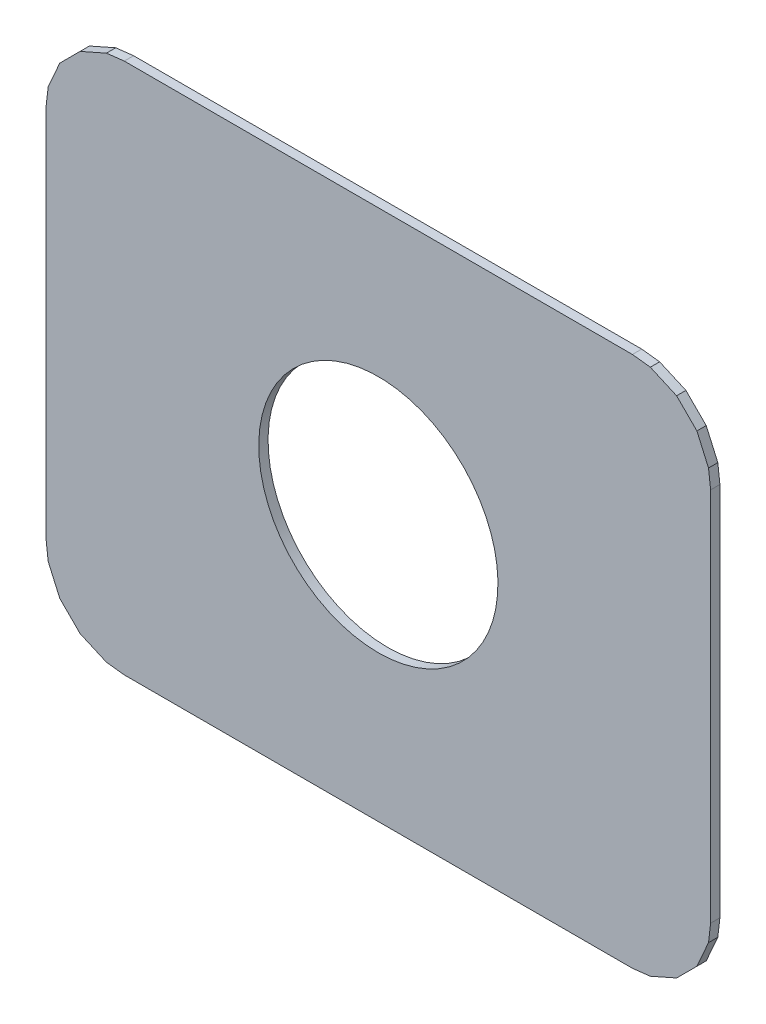
ISO-10303-21;
HEADER;
FILE_DESCRIPTION(('STEP AP214'),'2;1');
FILE_NAME('part.step','',(''),(''),'','','');
FILE_SCHEMA(('AUTOMOTIVE_DESIGN { 1 0 10303 214 1 1 1 1 }'));
ENDSEC;
DATA;
#1=APPLICATION_CONTEXT('core data for automotive mechanical design processes');
#2=APPLICATION_PROTOCOL_DEFINITION('international standard','automotive_design',2000,#1);
#3=PRODUCT_CONTEXT('',#1,'mechanical');
#4=PRODUCT('Part','Part','',(#3));
#5=PRODUCT_RELATED_PRODUCT_CATEGORY('part','',(#4));
#6=PRODUCT_DEFINITION_FORMATION('','',#4);
#7=PRODUCT_DEFINITION_CONTEXT('part definition',#1,'design');
#8=PRODUCT_DEFINITION('design','',#6,#7);
#9=PRODUCT_DEFINITION_SHAPE('','',#8);
#10=(LENGTH_UNIT() NAMED_UNIT(*) SI_UNIT(.MILLI.,.METRE.));
#11=(NAMED_UNIT(*) PLANE_ANGLE_UNIT() SI_UNIT($,.RADIAN.));
#12=(NAMED_UNIT(*) SI_UNIT($,.STERADIAN.) SOLID_ANGLE_UNIT());
#13=UNCERTAINTY_MEASURE_WITH_UNIT(LENGTH_MEASURE(1.E-05),#10,'distance_accuracy_value','');
#14=(GEOMETRIC_REPRESENTATION_CONTEXT(3) GLOBAL_UNCERTAINTY_ASSIGNED_CONTEXT((#13)) GLOBAL_UNIT_ASSIGNED_CONTEXT((#10,
#11,#12)) REPRESENTATION_CONTEXT('',''));
#15=CARTESIAN_POINT('',(0.,0.,0.));
#16=DIRECTION('',(0.,0.,1.));
#17=DIRECTION('',(1.,0.,0.));
#18=AXIS2_PLACEMENT_3D('',#15,#16,#17);
#19=CARTESIAN_POINT('',(177.26,-119.456,-0.045));
#20=DIRECTION('',(0.,0.,-1.));
#21=DIRECTION('',(0.,-1.,0.));
#22=AXIS2_PLACEMENT_3D('',#19,#20,#21);
#23=CYLINDRICAL_SURFACE('',#22,0.45);
#24=CARTESIAN_POINT('',(177.26,-119.456,1.67));
#25=DIRECTION('',(0.,0.,-1.));
#26=DIRECTION('',(0.,-1.,0.));
#27=AXIS2_PLACEMENT_3D('',#24,#25,#26);
#28=CIRCLE('',#27,0.45);
#29=CARTESIAN_POINT('',(177.26,-119.906,1.67));
#30=VERTEX_POINT('',#29);
#31=EDGE_CURVE('E302',#30,#30,#28,.T.);
#32=ORIENTED_EDGE('',*,*,#31,.T.);
#33=DIRECTION('',(0.,0.,1.));
#34=VECTOR('',#33,1.);
#35=CARTESIAN_POINT('',(177.26,-119.906,-0.045));
#36=LINE('',#35,#34);
#37=CARTESIAN_POINT('',(177.26,-119.906,1.705));
#38=VERTEX_POINT('',#37);
#39=EDGE_CURVE('E11',#30,#38,#36,.T.);
#40=ORIENTED_EDGE('',*,*,#39,.T.);
#41=CARTESIAN_POINT('',(177.26,-119.456,1.705));
#42=DIRECTION('',(0.,0.,-1.));
#43=DIRECTION('',(0.,-1.,0.));
#44=AXIS2_PLACEMENT_3D('',#41,#42,#43);
#45=CIRCLE('',#44,0.45);
#46=EDGE_CURVE('E420',#38,#38,#45,.T.);
#47=ORIENTED_EDGE('',*,*,#46,.F.);
#48=ORIENTED_EDGE('',*,*,#39,.F.);
#49=EDGE_LOOP('',(#32,#40,#47,#48));
#50=FACE_BOUND('',#49,.T.);
#51=ADVANCED_FACE('F17',(#50),#23,.F.);
#52=CARTESIAN_POINT('',(176.23678,-120.448188,1.67));
#53=DIRECTION('',(-0.403918300516903,-0.91479506257278,0.));
#54=DIRECTION('',(-0.91479506257278,0.403918300516903,0.));
#55=AXIS2_PLACEMENT_3D('',#52,#53,#54);
#56=PLANE('',#55);
#57=DIRECTION('',(0.,0.,1.));
#58=VECTOR('',#57,1.);
#59=CARTESIAN_POINT('',(176.23678,-120.448188,1.67));
#60=LINE('',#59,#58);
#61=CARTESIAN_POINT('',(176.23678,-120.448188,1.67));
#62=VERTEX_POINT('',#61);
#63=CARTESIAN_POINT('',(176.23678,-120.448188,1.705));
#64=VERTEX_POINT('',#63);
#65=EDGE_CURVE('E26',#62,#64,#60,.T.);
#66=ORIENTED_EDGE('',*,*,#65,.T.);
#67=DIRECTION('',(-0.91479506257278,0.403918300516903,0.));
#68=VECTOR('',#67,1.);
#69=CARTESIAN_POINT('',(176.23678,-120.448188,1.705));
#70=LINE('',#69,#68);
#71=CARTESIAN_POINT('',(176.137901,-120.404529,1.705));
#72=VERTEX_POINT('',#71);
#73=EDGE_CURVE('E378',#64,#72,#70,.T.);
#74=ORIENTED_EDGE('',*,*,#73,.T.);
#75=DIRECTION('',(0.,0.,1.));
#76=VECTOR('',#75,1.);
#77=CARTESIAN_POINT('',(176.137901,-120.404529,1.67));
#78=LINE('',#77,#76);
#79=CARTESIAN_POINT('',(176.137901,-120.404529,1.67));
#80=VERTEX_POINT('',#79);
#81=EDGE_CURVE('E20',#80,#72,#78,.T.);
#82=ORIENTED_EDGE('',*,*,#81,.F.);
#83=DIRECTION('',(-0.91479506257278,0.403918300516903,0.));
#84=VECTOR('',#83,1.);
#85=CARTESIAN_POINT('',(176.23678,-120.448188,1.67));
#86=LINE('',#85,#84);
#87=EDGE_CURVE('E320',#62,#80,#86,.T.);
#88=ORIENTED_EDGE('',*,*,#87,.F.);
#89=EDGE_LOOP('',(#66,#74,#82,#88));
#90=FACE_BOUND('',#89,.T.);
#91=ADVANCED_FACE('F477',(#90),#56,.T.);
#92=CARTESIAN_POINT('',(176.304118,-120.456,1.67));
#93=DIRECTION('',(-0.115238869062998,-0.99333780913498,0.));
#94=DIRECTION('',(-0.99333780913498,0.115238869062998,0.));
#95=AXIS2_PLACEMENT_3D('',#92,#93,#94);
#96=PLANE('',#95);
#97=DIRECTION('',(0.,0.,1.));
#98=VECTOR('',#97,1.);
#99=CARTESIAN_POINT('',(176.304118,-120.456,1.67));
#100=LINE('',#99,#98);
#101=CARTESIAN_POINT('',(176.304118,-120.456,1.67));
#102=VERTEX_POINT('',#101);
#103=CARTESIAN_POINT('',(176.304118,-120.456,1.705));
#104=VERTEX_POINT('',#103);
#105=EDGE_CURVE('E457',#102,#104,#100,.T.);
#106=ORIENTED_EDGE('',*,*,#105,.T.);
#107=DIRECTION('',(-0.99333780913498,0.115238869062998,0.));
#108=VECTOR('',#107,1.);
#109=CARTESIAN_POINT('',(176.304118,-120.456,1.705));
#110=LINE('',#109,#108);
#111=EDGE_CURVE('E382',#104,#64,#110,.T.);
#112=ORIENTED_EDGE('',*,*,#111,.T.);
#113=ORIENTED_EDGE('',*,*,#65,.F.);
#114=DIRECTION('',(-0.99333780913498,0.115238869062998,0.));
#115=VECTOR('',#114,1.);
#116=CARTESIAN_POINT('',(176.304118,-120.456,1.67));
#117=LINE('',#116,#115);
#118=EDGE_CURVE('E316',#102,#62,#117,.T.);
#119=ORIENTED_EDGE('',*,*,#118,.F.);
#120=EDGE_LOOP('',(#106,#112,#113,#119));
#121=FACE_BOUND('',#120,.T.);
#122=ADVANCED_FACE('F513',(#121),#96,.T.);
#123=CARTESIAN_POINT('',(176.137901,-120.404529,1.67));
#124=DIRECTION('',(-0.707106781187048,-0.707106781186048,0.));
#125=DIRECTION('',(-0.707106781186048,0.707106781187048,0.));
#126=AXIS2_PLACEMENT_3D('',#123,#124,#125);
#127=PLANE('',#126);
#128=ORIENTED_EDGE('',*,*,#81,.T.);
#129=DIRECTION('',(-0.707106781186048,0.707106781187048,0.));
#130=VECTOR('',#129,1.);
#131=CARTESIAN_POINT('',(176.137901,-120.404529,1.705));
#132=LINE('',#131,#130);
#133=CARTESIAN_POINT('',(176.061471,-120.328099,1.705));
#134=VERTEX_POINT('',#133);
#135=EDGE_CURVE('E357',#72,#134,#132,.T.);
#136=ORIENTED_EDGE('',*,*,#135,.T.);
#137=DIRECTION('',(0.,0.,1.));
#138=VECTOR('',#137,1.);
#139=CARTESIAN_POINT('',(176.061471,-120.328099,1.67));
#140=LINE('',#139,#138);
#141=CARTESIAN_POINT('',(176.061471,-120.328099,1.67));
#142=VERTEX_POINT('',#141);
#143=EDGE_CURVE('E455',#142,#134,#140,.T.);
#144=ORIENTED_EDGE('',*,*,#143,.F.);
#145=DIRECTION('',(-0.707106781186048,0.707106781187048,0.));
#146=VECTOR('',#145,1.);
#147=CARTESIAN_POINT('',(176.137901,-120.404529,1.67));
#148=LINE('',#147,#146);
#149=EDGE_CURVE('E324',#80,#142,#148,.T.);
#150=ORIENTED_EDGE('',*,*,#149,.F.);
#151=EDGE_LOOP('',(#128,#136,#144,#150));
#152=FACE_BOUND('',#151,.T.);
#153=ADVANCED_FACE('F470',(#152),#127,.T.);
#154=CARTESIAN_POINT('',(178.215882,-120.456,1.67));
#155=DIRECTION('',(0.,-1.,0.));
#156=DIRECTION('',(0.,0.,-1.));
#157=AXIS2_PLACEMENT_3D('',#154,#155,#156);
#158=PLANE('',#157);
#159=DIRECTION('',(0.,0.,1.));
#160=VECTOR('',#159,1.);
#161=CARTESIAN_POINT('',(178.215882,-120.456,1.67));
#162=LINE('',#161,#160);
#163=CARTESIAN_POINT('',(178.215882,-120.456,1.67));
#164=VERTEX_POINT('',#163);
#165=CARTESIAN_POINT('',(178.215882,-120.456,1.705));
#166=VERTEX_POINT('',#165);
#167=EDGE_CURVE('E452',#164,#166,#162,.T.);
#168=ORIENTED_EDGE('',*,*,#167,.T.);
#169=DIRECTION('',(-1.,0.,0.));
#170=VECTOR('',#169,1.);
#171=CARTESIAN_POINT('',(178.215882,-120.456,1.705));
#172=LINE('',#171,#170);
#173=EDGE_CURVE('E385',#166,#104,#172,.T.);
#174=ORIENTED_EDGE('',*,*,#173,.T.);
#175=ORIENTED_EDGE('',*,*,#105,.F.);
#176=DIRECTION('',(-1.,0.,0.));
#177=VECTOR('',#176,1.);
#178=CARTESIAN_POINT('',(178.215882,-120.456,1.67));
#179=LINE('',#178,#177);
#180=EDGE_CURVE('E306',#164,#102,#179,.T.);
#181=ORIENTED_EDGE('',*,*,#180,.F.);
#182=EDGE_LOOP('',(#168,#174,#175,#181));
#183=FACE_BOUND('',#182,.T.);
#184=ADVANCED_FACE('F510',(#183),#158,.T.);
#185=CARTESIAN_POINT('',(176.061471,-120.328099,1.67));
#186=DIRECTION('',(-0.914795062572411,-0.40391830051774,0.));
#187=DIRECTION('',(-0.40391830051774,0.914795062572411,0.));
#188=AXIS2_PLACEMENT_3D('',#185,#186,#187);
#189=PLANE('',#188);
#190=ORIENTED_EDGE('',*,*,#143,.T.);
#191=DIRECTION('',(-0.40391830051774,0.914795062572411,0.));
#192=VECTOR('',#191,1.);
#193=CARTESIAN_POINT('',(176.061471,-120.328099,1.705));
#194=LINE('',#193,#192);
#195=CARTESIAN_POINT('',(176.017812,-120.22922,1.705));
#196=VERTEX_POINT('',#195);
#197=EDGE_CURVE('E353',#134,#196,#194,.T.);
#198=ORIENTED_EDGE('',*,*,#197,.T.);
#199=DIRECTION('',(0.,0.,1.));
#200=VECTOR('',#199,1.);
#201=CARTESIAN_POINT('',(176.017812,-120.22922,1.67));
#202=LINE('',#201,#200);
#203=CARTESIAN_POINT('',(176.017812,-120.22922,1.67));
#204=VERTEX_POINT('',#203);
#205=EDGE_CURVE('E451',#204,#196,#202,.T.);
#206=ORIENTED_EDGE('',*,*,#205,.F.);
#207=DIRECTION('',(-0.40391830051774,0.914795062572411,0.));
#208=VECTOR('',#207,1.);
#209=CARTESIAN_POINT('',(176.061471,-120.328099,1.67));
#210=LINE('',#209,#208);
#211=EDGE_CURVE('E275',#142,#204,#210,.T.);
#212=ORIENTED_EDGE('',*,*,#211,.F.);
#213=EDGE_LOOP('',(#190,#198,#206,#212));
#214=FACE_BOUND('',#213,.T.);
#215=ADVANCED_FACE('F615',(#214),#189,.T.);
#216=CARTESIAN_POINT('',(178.28322,-120.448188,1.67));
#217=DIRECTION('',(0.115238869062998,-0.99333780913498,0.));
#218=DIRECTION('',(0.,0.,-1.));
#219=AXIS2_PLACEMENT_3D('',#216,#217,#218);
#220=PLANE('',#219);
#221=DIRECTION('',(0.,0.,1.));
#222=VECTOR('',#221,1.);
#223=CARTESIAN_POINT('',(178.28322,-120.448188,1.67));
#224=LINE('',#223,#222);
#225=CARTESIAN_POINT('',(178.28322,-120.448188,1.67));
#226=VERTEX_POINT('',#225);
#227=CARTESIAN_POINT('',(178.28322,-120.448188,1.705));
#228=VERTEX_POINT('',#227);
#229=EDGE_CURVE('E283',#226,#228,#224,.T.);
#230=ORIENTED_EDGE('',*,*,#229,.T.);
#231=DIRECTION('',(-0.99333780913498,-0.115238869062998,0.));
#232=VECTOR('',#231,1.);
#233=CARTESIAN_POINT('',(178.28322,-120.448188,1.705));
#234=LINE('',#233,#232);
#235=EDGE_CURVE('E392',#228,#166,#234,.T.);
#236=ORIENTED_EDGE('',*,*,#235,.T.);
#237=ORIENTED_EDGE('',*,*,#167,.F.);
#238=DIRECTION('',(-0.99333780913498,-0.115238869062998,0.));
#239=VECTOR('',#238,1.);
#240=CARTESIAN_POINT('',(178.28322,-120.448188,1.67));
#241=LINE('',#240,#239);
#242=EDGE_CURVE('E296',#226,#164,#241,.T.);
#243=ORIENTED_EDGE('',*,*,#242,.F.);
#244=EDGE_LOOP('',(#230,#236,#237,#243));
#245=FACE_BOUND('',#244,.T.);
#246=ADVANCED_FACE('F518',(#245),#220,.T.);
#247=CARTESIAN_POINT('',(176.017812,-120.22922,1.67));
#248=DIRECTION('',(-0.99333780913498,-0.115238869062998,0.));
#249=DIRECTION('',(-0.115238869062998,0.99333780913498,0.));
#250=AXIS2_PLACEMENT_3D('',#247,#248,#249);
#251=PLANE('',#250);
#252=ORIENTED_EDGE('',*,*,#205,.T.);
#253=DIRECTION('',(-0.115238869062998,0.99333780913498,0.));
#254=VECTOR('',#253,1.);
#255=CARTESIAN_POINT('',(176.017812,-120.22922,1.705));
#256=LINE('',#255,#254);
#257=CARTESIAN_POINT('',(176.01,-120.161882,1.705));
#258=VERTEX_POINT('',#257);
#259=EDGE_CURVE('E358',#196,#258,#256,.T.);
#260=ORIENTED_EDGE('',*,*,#259,.T.);
#261=DIRECTION('',(0.,0.,1.));
#262=VECTOR('',#261,1.);
#263=CARTESIAN_POINT('',(176.01,-120.161882,1.67));
#264=LINE('',#263,#262);
#265=CARTESIAN_POINT('',(176.01,-120.161882,1.67));
#266=VERTEX_POINT('',#265);
#267=EDGE_CURVE('E280',#266,#258,#264,.T.);
#268=ORIENTED_EDGE('',*,*,#267,.F.);
#269=DIRECTION('',(-0.115238869062998,0.99333780913498,0.));
#270=VECTOR('',#269,1.);
#271=CARTESIAN_POINT('',(176.017812,-120.22922,1.67));
#272=LINE('',#271,#270);
#273=EDGE_CURVE('E325',#204,#266,#272,.T.);
#274=ORIENTED_EDGE('',*,*,#273,.F.);
#275=EDGE_LOOP('',(#252,#260,#268,#274));
#276=FACE_BOUND('',#275,.T.);
#277=ADVANCED_FACE('F610',(#276),#251,.T.);
#278=CARTESIAN_POINT('',(178.382099,-120.404529,1.67));
#279=DIRECTION('',(0.403918300516903,-0.91479506257278,0.));
#280=DIRECTION('',(0.,0.,-1.));
#281=AXIS2_PLACEMENT_3D('',#278,#279,#280);
#282=PLANE('',#281);
#283=DIRECTION('',(0.,0.,1.));
#284=VECTOR('',#283,1.);
#285=CARTESIAN_POINT('',(178.382099,-120.404529,1.67));
#286=LINE('',#285,#284);
#287=CARTESIAN_POINT('',(178.382099,-120.404529,1.67));
#288=VERTEX_POINT('',#287);
#289=CARTESIAN_POINT('',(178.382099,-120.404529,1.705));
#290=VERTEX_POINT('',#289);
#291=EDGE_CURVE('E284',#288,#290,#286,.T.);
#292=ORIENTED_EDGE('',*,*,#291,.T.);
#293=DIRECTION('',(-0.91479506257278,-0.403918300516903,0.));
#294=VECTOR('',#293,1.);
#295=CARTESIAN_POINT('',(178.382099,-120.404529,1.705));
#296=LINE('',#295,#294);
#297=EDGE_CURVE('E396',#290,#228,#296,.T.);
#298=ORIENTED_EDGE('',*,*,#297,.T.);
#299=ORIENTED_EDGE('',*,*,#229,.F.);
#300=DIRECTION('',(-0.91479506257278,-0.403918300516903,0.));
#301=VECTOR('',#300,1.);
#302=CARTESIAN_POINT('',(178.382099,-120.404529,1.67));
#303=LINE('',#302,#301);
#304=EDGE_CURVE('E292',#288,#226,#303,.T.);
#305=ORIENTED_EDGE('',*,*,#304,.F.);
#306=EDGE_LOOP('',(#292,#298,#299,#305));
#307=FACE_BOUND('',#306,.T.);
#308=ADVANCED_FACE('F523',(#307),#282,.T.);
#309=CARTESIAN_POINT('',(176.01,-120.161882,1.67));
#310=DIRECTION('',(-1.,0.,0.));
#311=DIRECTION('',(0.,0.,1.));
#312=AXIS2_PLACEMENT_3D('',#309,#310,#311);
#313=PLANE('',#312);
#314=ORIENTED_EDGE('',*,*,#267,.T.);
#315=DIRECTION('',(0.,1.,0.));
#316=VECTOR('',#315,1.);
#317=CARTESIAN_POINT('',(176.01,-120.161882,1.705));
#318=LINE('',#317,#316);
#319=CARTESIAN_POINT('',(176.01,-118.750118,1.705));
#320=VERTEX_POINT('',#319);
#321=EDGE_CURVE('E371',#258,#320,#318,.T.);
#322=ORIENTED_EDGE('',*,*,#321,.T.);
#323=DIRECTION('',(0.,0.,1.));
#324=VECTOR('',#323,1.);
#325=CARTESIAN_POINT('',(176.01,-118.750118,1.67));
#326=LINE('',#325,#324);
#327=CARTESIAN_POINT('',(176.01,-118.750118,1.67));
#328=VERTEX_POINT('',#327);
#329=EDGE_CURVE('E291',#328,#320,#326,.T.);
#330=ORIENTED_EDGE('',*,*,#329,.F.);
#331=DIRECTION('',(0.,1.,0.));
#332=VECTOR('',#331,1.);
#333=CARTESIAN_POINT('',(176.01,-120.161882,1.67));
#334=LINE('',#333,#332);
#335=EDGE_CURVE('E329',#266,#328,#334,.T.);
#336=ORIENTED_EDGE('',*,*,#335,.F.);
#337=EDGE_LOOP('',(#314,#322,#330,#336));
#338=FACE_BOUND('',#337,.T.);
#339=ADVANCED_FACE('F608',(#338),#313,.T.);
#340=CARTESIAN_POINT('',(178.458529,-120.328099,1.67));
#341=DIRECTION('',(0.707106781187048,-0.707106781186048,0.));
#342=DIRECTION('',(0.,0.,-1.));
#343=AXIS2_PLACEMENT_3D('',#340,#341,#342);
#344=PLANE('',#343);
#345=DIRECTION('',(0.,0.,1.));
#346=VECTOR('',#345,1.);
#347=CARTESIAN_POINT('',(178.458529,-120.328099,1.67));
#348=LINE('',#347,#346);
#349=CARTESIAN_POINT('',(178.458529,-120.328099,1.67));
#350=VERTEX_POINT('',#349);
#351=CARTESIAN_POINT('',(178.458529,-120.328099,1.705));
#352=VERTEX_POINT('',#351);
#353=EDGE_CURVE('E446',#350,#352,#348,.T.);
#354=ORIENTED_EDGE('',*,*,#353,.T.);
#355=DIRECTION('',(-0.707106781186048,-0.707106781187048,0.));
#356=VECTOR('',#355,1.);
#357=CARTESIAN_POINT('',(178.458529,-120.328099,1.705));
#358=LINE('',#357,#356);
#359=EDGE_CURVE('E400',#352,#290,#358,.T.);
#360=ORIENTED_EDGE('',*,*,#359,.T.);
#361=ORIENTED_EDGE('',*,*,#291,.F.);
#362=DIRECTION('',(-0.707106781186048,-0.707106781187048,0.));
#363=VECTOR('',#362,1.);
#364=CARTESIAN_POINT('',(178.458529,-120.328099,1.67));
#365=LINE('',#364,#363);
#366=EDGE_CURVE('E297',#350,#288,#365,.T.);
#367=ORIENTED_EDGE('',*,*,#366,.F.);
#368=EDGE_LOOP('',(#354,#360,#361,#367));
#369=FACE_BOUND('',#368,.T.);
#370=ADVANCED_FACE('F526',(#369),#344,.T.);
#371=CARTESIAN_POINT('',(176.01,-118.750118,1.67));
#372=DIRECTION('',(-0.99333780913498,0.115238869062998,0.));
#373=DIRECTION('',(0.,0.,1.));
#374=AXIS2_PLACEMENT_3D('',#371,#372,#373);
#375=PLANE('',#374);
#376=ORIENTED_EDGE('',*,*,#329,.T.);
#377=DIRECTION('',(0.115238869062998,0.99333780913498,0.));
#378=VECTOR('',#377,1.);
#379=CARTESIAN_POINT('',(176.01,-118.750118,1.705));
#380=LINE('',#379,#378);
#381=CARTESIAN_POINT('',(176.017812,-118.68278,1.705));
#382=VERTEX_POINT('',#381);
#383=EDGE_CURVE('E367',#320,#382,#380,.T.);
#384=ORIENTED_EDGE('',*,*,#383,.T.);
#385=DIRECTION('',(0.,0.,1.));
#386=VECTOR('',#385,1.);
#387=CARTESIAN_POINT('',(176.017812,-118.68278,1.67));
#388=LINE('',#387,#386);
#389=CARTESIAN_POINT('',(176.017812,-118.68278,1.67));
#390=VERTEX_POINT('',#389);
#391=EDGE_CURVE('E414',#390,#382,#388,.T.);
#392=ORIENTED_EDGE('',*,*,#391,.F.);
#393=DIRECTION('',(0.115238869062998,0.99333780913498,0.));
#394=VECTOR('',#393,1.);
#395=CARTESIAN_POINT('',(176.01,-118.750118,1.67));
#396=LINE('',#395,#394);
#397=EDGE_CURVE('E333',#328,#390,#396,.T.);
#398=ORIENTED_EDGE('',*,*,#397,.F.);
#399=EDGE_LOOP('',(#376,#384,#392,#398));
#400=FACE_BOUND('',#399,.T.);
#401=ADVANCED_FACE('F604',(#400),#375,.T.);
#402=CARTESIAN_POINT('',(178.502188,-120.22922,1.67));
#403=DIRECTION('',(0.91479506257278,-0.403918300516903,0.));
#404=DIRECTION('',(0.,0.,-1.));
#405=AXIS2_PLACEMENT_3D('',#402,#403,#404);
#406=PLANE('',#405);
#407=DIRECTION('',(0.,0.,1.));
#408=VECTOR('',#407,1.);
#409=CARTESIAN_POINT('',(178.502188,-120.22922,1.67));
#410=LINE('',#409,#408);
#411=CARTESIAN_POINT('',(178.502188,-120.22922,1.67));
#412=VERTEX_POINT('',#411);
#413=CARTESIAN_POINT('',(178.502188,-120.22922,1.705));
#414=VERTEX_POINT('',#413);
#415=EDGE_CURVE('E411',#412,#414,#410,.T.);
#416=ORIENTED_EDGE('',*,*,#415,.T.);
#417=DIRECTION('',(-0.403918300516903,-0.91479506257278,0.));
#418=VECTOR('',#417,1.);
#419=CARTESIAN_POINT('',(178.502188,-120.22922,1.705));
#420=LINE('',#419,#418);
#421=EDGE_CURVE('E406',#414,#352,#420,.T.);
#422=ORIENTED_EDGE('',*,*,#421,.T.);
#423=ORIENTED_EDGE('',*,*,#353,.F.);
#424=DIRECTION('',(-0.403918300516903,-0.91479506257278,0.));
#425=VECTOR('',#424,1.);
#426=CARTESIAN_POINT('',(178.502188,-120.22922,1.67));
#427=LINE('',#426,#425);
#428=EDGE_CURVE('E500',#412,#350,#427,.T.);
#429=ORIENTED_EDGE('',*,*,#428,.F.);
#430=EDGE_LOOP('',(#416,#422,#423,#429));
#431=FACE_BOUND('',#430,.T.);
#432=ADVANCED_FACE('F529',(#431),#406,.T.);
#433=CARTESIAN_POINT('',(176.017812,-118.68278,1.67));
#434=DIRECTION('',(-0.914795062572411,0.40391830051774,0.));
#435=DIRECTION('',(0.,0.,1.));
#436=AXIS2_PLACEMENT_3D('',#433,#434,#435);
#437=PLANE('',#436);
#438=ORIENTED_EDGE('',*,*,#391,.T.);
#439=DIRECTION('',(0.40391830051774,0.914795062572411,0.));
#440=VECTOR('',#439,1.);
#441=CARTESIAN_POINT('',(176.017812,-118.68278,1.705));
#442=LINE('',#441,#440);
#443=CARTESIAN_POINT('',(176.061471,-118.583901,1.705));
#444=VERTEX_POINT('',#443);
#445=EDGE_CURVE('E311',#382,#444,#442,.T.);
#446=ORIENTED_EDGE('',*,*,#445,.T.);
#447=DIRECTION('',(0.,0.,1.));
#448=VECTOR('',#447,1.);
#449=CARTESIAN_POINT('',(176.061471,-118.583901,1.67));
#450=LINE('',#449,#448);
#451=CARTESIAN_POINT('',(176.061471,-118.583901,1.67));
#452=VERTEX_POINT('',#451);
#453=EDGE_CURVE('E415',#452,#444,#450,.T.);
#454=ORIENTED_EDGE('',*,*,#453,.F.);
#455=DIRECTION('',(0.40391830051774,0.914795062572411,0.));
#456=VECTOR('',#455,1.);
#457=CARTESIAN_POINT('',(176.017812,-118.68278,1.67));
#458=LINE('',#457,#456);
#459=EDGE_CURVE('E337',#390,#452,#458,.T.);
#460=ORIENTED_EDGE('',*,*,#459,.F.);
#461=EDGE_LOOP('',(#438,#446,#454,#460));
#462=FACE_BOUND('',#461,.T.);
#463=ADVANCED_FACE('F602',(#462),#437,.T.);
#464=CARTESIAN_POINT('',(178.51,-120.161882,1.67));
#465=DIRECTION('',(0.99333780913498,-0.115238869062998,0.));
#466=DIRECTION('',(0.,0.,-1.));
#467=AXIS2_PLACEMENT_3D('',#464,#465,#466);
#468=PLANE('',#467);
#469=DIRECTION('',(0.,0.,1.));
#470=VECTOR('',#469,1.);
#471=CARTESIAN_POINT('',(178.51,-120.161882,1.67));
#472=LINE('',#471,#470);
#473=CARTESIAN_POINT('',(178.51,-120.161882,1.67));
#474=VERTEX_POINT('',#473);
#475=CARTESIAN_POINT('',(178.51,-120.161882,1.705));
#476=VERTEX_POINT('',#475);
#477=EDGE_CURVE('E390',#474,#476,#472,.T.);
#478=ORIENTED_EDGE('',*,*,#477,.T.);
#479=DIRECTION('',(-0.115238869062998,-0.99333780913498,0.));
#480=VECTOR('',#479,1.);
#481=CARTESIAN_POINT('',(178.51,-120.161882,1.705));
#482=LINE('',#481,#480);
#483=EDGE_CURVE('E410',#476,#414,#482,.T.);
#484=ORIENTED_EDGE('',*,*,#483,.T.);
#485=ORIENTED_EDGE('',*,*,#415,.F.);
#486=DIRECTION('',(-0.115238869062998,-0.99333780913498,0.));
#487=VECTOR('',#486,1.);
#488=CARTESIAN_POINT('',(178.51,-120.161882,1.67));
#489=LINE('',#488,#487);
#490=EDGE_CURVE('E288',#474,#412,#489,.T.);
#491=ORIENTED_EDGE('',*,*,#490,.F.);
#492=EDGE_LOOP('',(#478,#484,#485,#491));
#493=FACE_BOUND('',#492,.T.);
#494=ADVANCED_FACE('F534',(#493),#468,.T.);
#495=CARTESIAN_POINT('',(176.061471,-118.583901,1.67));
#496=DIRECTION('',(-0.707106781187048,0.707106781186048,0.));
#497=DIRECTION('',(0.,0.,1.));
#498=AXIS2_PLACEMENT_3D('',#495,#496,#497);
#499=PLANE('',#498);
#500=ORIENTED_EDGE('',*,*,#453,.T.);
#501=DIRECTION('',(0.707106781186048,0.707106781187048,0.));
#502=VECTOR('',#501,1.);
#503=CARTESIAN_POINT('',(176.061471,-118.583901,1.705));
#504=LINE('',#503,#502);
#505=CARTESIAN_POINT('',(176.137901,-118.507471,1.705));
#506=VERTEX_POINT('',#505);
#507=EDGE_CURVE('E307',#444,#506,#504,.T.);
#508=ORIENTED_EDGE('',*,*,#507,.T.);
#509=DIRECTION('',(0.,0.,1.));
#510=VECTOR('',#509,1.);
#511=CARTESIAN_POINT('',(176.137901,-118.507471,1.67));
#512=LINE('',#511,#510);
#513=CARTESIAN_POINT('',(176.137901,-118.507471,1.67));
#514=VERTEX_POINT('',#513);
#515=EDGE_CURVE('E387',#514,#506,#512,.T.);
#516=ORIENTED_EDGE('',*,*,#515,.F.);
#517=DIRECTION('',(0.707106781186048,0.707106781187048,0.));
#518=VECTOR('',#517,1.);
#519=CARTESIAN_POINT('',(176.061471,-118.583901,1.67));
#520=LINE('',#519,#518);
#521=EDGE_CURVE('E338',#452,#514,#520,.T.);
#522=ORIENTED_EDGE('',*,*,#521,.F.);
#523=EDGE_LOOP('',(#500,#508,#516,#522));
#524=FACE_BOUND('',#523,.T.);
#525=ADVANCED_FACE('F585',(#524),#499,.T.);
#526=CARTESIAN_POINT('',(178.51,-118.750118,1.67));
#527=DIRECTION('',(1.,0.,0.));
#528=DIRECTION('',(0.,1.,0.));
#529=AXIS2_PLACEMENT_3D('',#526,#527,#528);
#530=PLANE('',#529);
#531=DIRECTION('',(0.,0.,1.));
#532=VECTOR('',#531,1.);
#533=CARTESIAN_POINT('',(178.51,-118.750118,1.67));
#534=LINE('',#533,#532);
#535=CARTESIAN_POINT('',(178.51,-118.750118,1.67));
#536=VERTEX_POINT('',#535);
#537=CARTESIAN_POINT('',(178.51,-118.750118,1.705));
#538=VERTEX_POINT('',#537);
#539=EDGE_CURVE('E391',#536,#538,#534,.T.);
#540=ORIENTED_EDGE('',*,*,#539,.T.);
#541=DIRECTION('',(0.,-1.,0.));
#542=VECTOR('',#541,1.);
#543=CARTESIAN_POINT('',(178.51,-118.750118,1.705));
#544=LINE('',#543,#542);
#545=EDGE_CURVE('E419',#538,#476,#544,.T.);
#546=ORIENTED_EDGE('',*,*,#545,.T.);
#547=ORIENTED_EDGE('',*,*,#477,.F.);
#548=DIRECTION('',(0.,-1.,0.));
#549=VECTOR('',#548,1.);
#550=CARTESIAN_POINT('',(178.51,-118.750118,1.67));
#551=LINE('',#550,#549);
#552=EDGE_CURVE('E279',#536,#474,#551,.T.);
#553=ORIENTED_EDGE('',*,*,#552,.F.);
#554=EDGE_LOOP('',(#540,#546,#547,#553));
#555=FACE_BOUND('',#554,.T.);
#556=ADVANCED_FACE('F539',(#555),#530,.T.);
#557=CARTESIAN_POINT('',(176.137901,-118.507471,1.67));
#558=DIRECTION('',(-0.403918300516903,0.91479506257278,0.));
#559=DIRECTION('',(0.,0.,1.));
#560=AXIS2_PLACEMENT_3D('',#557,#558,#559);
#561=PLANE('',#560);
#562=ORIENTED_EDGE('',*,*,#515,.T.);
#563=DIRECTION('',(0.91479506257278,0.403918300516903,0.));
#564=VECTOR('',#563,1.);
#565=CARTESIAN_POINT('',(176.137901,-118.507471,1.705));
#566=LINE('',#565,#564);
#567=CARTESIAN_POINT('',(176.23678,-118.463812,1.705));
#568=VERTEX_POINT('',#567);
#569=EDGE_CURVE('E312',#506,#568,#566,.T.);
#570=ORIENTED_EDGE('',*,*,#569,.T.);
#571=DIRECTION('',(0.,0.,1.));
#572=VECTOR('',#571,1.);
#573=CARTESIAN_POINT('',(176.23678,-118.463812,1.67));
#574=LINE('',#573,#572);
#575=CARTESIAN_POINT('',(176.23678,-118.463812,1.67));
#576=VERTEX_POINT('',#575);
#577=EDGE_CURVE('E437',#576,#568,#574,.T.);
#578=ORIENTED_EDGE('',*,*,#577,.F.);
#579=DIRECTION('',(0.91479506257278,0.403918300516903,0.));
#580=VECTOR('',#579,1.);
#581=CARTESIAN_POINT('',(176.137901,-118.507471,1.67));
#582=LINE('',#581,#580);
#583=EDGE_CURVE('E342',#514,#576,#582,.T.);
#584=ORIENTED_EDGE('',*,*,#583,.F.);
#585=EDGE_LOOP('',(#562,#570,#578,#584));
#586=FACE_BOUND('',#585,.T.);
#587=ADVANCED_FACE('F582',(#586),#561,.T.);
#588=CARTESIAN_POINT('',(178.502188,-118.68278,1.67));
#589=DIRECTION('',(0.99333780913498,0.115238869062998,0.));
#590=DIRECTION('',(0.,0.,-1.));
#591=AXIS2_PLACEMENT_3D('',#588,#589,#590);
#592=PLANE('',#591);
#593=DIRECTION('',(0.,0.,1.));
#594=VECTOR('',#593,1.);
#595=CARTESIAN_POINT('',(178.502188,-118.68278,1.67));
#596=LINE('',#595,#594);
#597=CARTESIAN_POINT('',(178.502188,-118.68278,1.67));
#598=VERTEX_POINT('',#597);
#599=CARTESIAN_POINT('',(178.502188,-118.68278,1.705));
#600=VERTEX_POINT('',#599);
#601=EDGE_CURVE('E47',#598,#600,#596,.T.);
#602=ORIENTED_EDGE('',*,*,#601,.T.);
#603=DIRECTION('',(0.115238869062998,-0.99333780913498,0.));
#604=VECTOR('',#603,1.);
#605=CARTESIAN_POINT('',(178.502188,-118.68278,1.705));
#606=LINE('',#605,#604);
#607=EDGE_CURVE('E428',#600,#538,#606,.T.);
#608=ORIENTED_EDGE('',*,*,#607,.T.);
#609=ORIENTED_EDGE('',*,*,#539,.F.);
#610=DIRECTION('',(0.115238869062998,-0.99333780913498,0.));
#611=VECTOR('',#610,1.);
#612=CARTESIAN_POINT('',(178.502188,-118.68278,1.67));
#613=LINE('',#612,#611);
#614=EDGE_CURVE('E251',#598,#536,#613,.T.);
#615=ORIENTED_EDGE('',*,*,#614,.F.);
#616=EDGE_LOOP('',(#602,#608,#609,#615));
#617=FACE_BOUND('',#616,.T.);
#618=ADVANCED_FACE('F540',(#617),#592,.T.);
#619=CARTESIAN_POINT('',(176.23678,-118.463812,1.67));
#620=DIRECTION('',(-0.115238869062998,0.99333780913498,0.));
#621=DIRECTION('',(0.,0.,1.));
#622=AXIS2_PLACEMENT_3D('',#619,#620,#621);
#623=PLANE('',#622);
#624=ORIENTED_EDGE('',*,*,#577,.T.);
#625=DIRECTION('',(0.99333780913498,0.115238869062998,0.));
#626=VECTOR('',#625,1.);
#627=CARTESIAN_POINT('',(176.23678,-118.463812,1.705));
#628=LINE('',#627,#626);
#629=CARTESIAN_POINT('',(176.304118,-118.456,1.705));
#630=VERTEX_POINT('',#629);
#631=EDGE_CURVE('E301',#568,#630,#628,.T.);
#632=ORIENTED_EDGE('',*,*,#631,.T.);
#633=DIRECTION('',(0.,0.,1.));
#634=VECTOR('',#633,1.);
#635=CARTESIAN_POINT('',(176.304118,-118.456,1.67));
#636=LINE('',#635,#634);
#637=CARTESIAN_POINT('',(176.304118,-118.456,1.67));
#638=VERTEX_POINT('',#637);
#639=EDGE_CURVE('E423',#638,#630,#636,.T.);
#640=ORIENTED_EDGE('',*,*,#639,.F.);
#641=DIRECTION('',(0.99333780913498,0.115238869062998,0.));
#642=VECTOR('',#641,1.);
#643=CARTESIAN_POINT('',(176.23678,-118.463812,1.67));
#644=LINE('',#643,#642);
#645=EDGE_CURVE('E346',#576,#638,#644,.T.);
#646=ORIENTED_EDGE('',*,*,#645,.F.);
#647=EDGE_LOOP('',(#624,#632,#640,#646));
#648=FACE_BOUND('',#647,.T.);
#649=ADVANCED_FACE('F578',(#648),#623,.T.);
#650=CARTESIAN_POINT('',(178.458529,-118.583901,1.67));
#651=DIRECTION('',(0.91479506257278,0.403918300516903,0.));
#652=DIRECTION('',(0.,0.,-1.));
#653=AXIS2_PLACEMENT_3D('',#650,#651,#652);
#654=PLANE('',#653);
#655=DIRECTION('',(0.,0.,1.));
#656=VECTOR('',#655,1.);
#657=CARTESIAN_POINT('',(178.458529,-118.583901,1.67));
#658=LINE('',#657,#656);
#659=CARTESIAN_POINT('',(178.458529,-118.583901,1.67));
#660=VERTEX_POINT('',#659);
#661=CARTESIAN_POINT('',(178.458529,-118.583901,1.705));
#662=VERTEX_POINT('',#661);
#663=EDGE_CURVE('E246',#660,#662,#658,.T.);
#664=ORIENTED_EDGE('',*,*,#663,.T.);
#665=DIRECTION('',(0.403918300516903,-0.91479506257278,0.));
#666=VECTOR('',#665,1.);
#667=CARTESIAN_POINT('',(178.458529,-118.583901,1.705));
#668=LINE('',#667,#666);
#669=EDGE_CURVE('E424',#662,#600,#668,.T.);
#670=ORIENTED_EDGE('',*,*,#669,.T.);
#671=ORIENTED_EDGE('',*,*,#601,.F.);
#672=DIRECTION('',(0.403918300516903,-0.91479506257278,0.));
#673=VECTOR('',#672,1.);
#674=CARTESIAN_POINT('',(178.458529,-118.583901,1.67));
#675=LINE('',#674,#673);
#676=EDGE_CURVE('E242',#660,#598,#675,.T.);
#677=ORIENTED_EDGE('',*,*,#676,.F.);
#678=EDGE_LOOP('',(#664,#670,#671,#677));
#679=FACE_BOUND('',#678,.T.);
#680=ADVANCED_FACE('F244',(#679),#654,.T.);
#681=CARTESIAN_POINT('',(176.304118,-118.456,1.67));
#682=DIRECTION('',(0.,1.,0.));
#683=DIRECTION('',(1.,0.,0.));
#684=AXIS2_PLACEMENT_3D('',#681,#682,#683);
#685=PLANE('',#684);
#686=ORIENTED_EDGE('',*,*,#639,.T.);
#687=DIRECTION('',(1.,0.,0.));
#688=VECTOR('',#687,1.);
#689=CARTESIAN_POINT('',(176.304118,-118.456,1.705));
#690=LINE('',#689,#688);
#691=CARTESIAN_POINT('',(178.215882,-118.456,1.705));
#692=VERTEX_POINT('',#691);
#693=EDGE_CURVE('E298',#630,#692,#690,.T.);
#694=ORIENTED_EDGE('',*,*,#693,.T.);
#695=DIRECTION('',(0.,0.,1.));
#696=VECTOR('',#695,1.);
#697=CARTESIAN_POINT('',(178.215882,-118.456,1.67));
#698=LINE('',#697,#696);
#699=CARTESIAN_POINT('',(178.215882,-118.456,1.67));
#700=VERTEX_POINT('',#699);
#701=EDGE_CURVE('E493',#700,#692,#698,.T.);
#702=ORIENTED_EDGE('',*,*,#701,.F.);
#703=DIRECTION('',(1.,0.,0.));
#704=VECTOR('',#703,1.);
#705=CARTESIAN_POINT('',(176.304118,-118.456,1.67));
#706=LINE('',#705,#704);
#707=EDGE_CURVE('E350',#638,#700,#706,.T.);
#708=ORIENTED_EDGE('',*,*,#707,.F.);
#709=EDGE_LOOP('',(#686,#694,#702,#708));
#710=FACE_BOUND('',#709,.T.);
#711=ADVANCED_FACE('F572',(#710),#685,.T.);
#712=CARTESIAN_POINT('',(0.,0.,1.705));
#713=DIRECTION('',(0.,0.,1.));
#714=DIRECTION('',(1.,0.,0.));
#715=AXIS2_PLACEMENT_3D('',#712,#713,#714);
#716=PLANE('',#715);
#717=ORIENTED_EDGE('',*,*,#46,.T.);
#718=EDGE_LOOP('',(#717));
#719=FACE_BOUND('',#718,.T.);
#720=DIRECTION('',(0.91479506257278,-0.403918300516903,0.));
#721=VECTOR('',#720,1.);
#722=CARTESIAN_POINT('',(178.28322,-118.463812,1.705));
#723=LINE('',#722,#721);
#724=CARTESIAN_POINT('',(178.28322,-118.463812,1.705));
#725=VERTEX_POINT('',#724);
#726=CARTESIAN_POINT('',(178.382099,-118.507471,1.705));
#727=VERTEX_POINT('',#726);
#728=EDGE_CURVE('E543',#725,#727,#723,.T.);
#729=ORIENTED_EDGE('',*,*,#728,.F.);
#730=DIRECTION('',(0.99333780913498,-0.115238869062998,0.));
#731=VECTOR('',#730,1.);
#732=CARTESIAN_POINT('',(178.215882,-118.456,1.705));
#733=LINE('',#732,#731);
#734=EDGE_CURVE('E490',#692,#725,#733,.T.);
#735=ORIENTED_EDGE('',*,*,#734,.F.);
#736=ORIENTED_EDGE('',*,*,#693,.F.);
#737=ORIENTED_EDGE('',*,*,#631,.F.);
#738=ORIENTED_EDGE('',*,*,#569,.F.);
#739=ORIENTED_EDGE('',*,*,#507,.F.);
#740=ORIENTED_EDGE('',*,*,#445,.F.);
#741=ORIENTED_EDGE('',*,*,#383,.F.);
#742=ORIENTED_EDGE('',*,*,#321,.F.);
#743=ORIENTED_EDGE('',*,*,#259,.F.);
#744=ORIENTED_EDGE('',*,*,#197,.F.);
#745=ORIENTED_EDGE('',*,*,#135,.F.);
#746=ORIENTED_EDGE('',*,*,#73,.F.);
#747=ORIENTED_EDGE('',*,*,#111,.F.);
#748=ORIENTED_EDGE('',*,*,#173,.F.);
#749=ORIENTED_EDGE('',*,*,#235,.F.);
#750=ORIENTED_EDGE('',*,*,#297,.F.);
#751=ORIENTED_EDGE('',*,*,#359,.F.);
#752=ORIENTED_EDGE('',*,*,#421,.F.);
#753=ORIENTED_EDGE('',*,*,#483,.F.);
#754=ORIENTED_EDGE('',*,*,#545,.F.);
#755=ORIENTED_EDGE('',*,*,#607,.F.);
#756=ORIENTED_EDGE('',*,*,#669,.F.);
#757=DIRECTION('',(0.707106781186048,-0.707106781187048,0.));
#758=VECTOR('',#757,1.);
#759=CARTESIAN_POINT('',(178.382099,-118.507471,1.705));
#760=LINE('',#759,#758);
#761=EDGE_CURVE('E264',#727,#662,#760,.T.);
#762=ORIENTED_EDGE('',*,*,#761,.F.);
#763=EDGE_LOOP('',(#729,#735,#736,#737,#738,#739,#740,#741,#742,#743,#744,#745,#746,#747,#748,
#749,#750,#751,#752,#753,#754,#755,#756,#762));
#764=FACE_BOUND('',#763,.T.);
#765=ADVANCED_FACE('F481',(#719,#764),#716,.T.);
#766=CARTESIAN_POINT('',(0.,0.,1.67));
#767=DIRECTION('',(0.,0.,1.));
#768=DIRECTION('',(1.,0.,0.));
#769=AXIS2_PLACEMENT_3D('',#766,#767,#768);
#770=PLANE('',#769);
#771=ORIENTED_EDGE('',*,*,#31,.F.);
#772=EDGE_LOOP('',(#771));
#773=FACE_BOUND('',#772,.T.);
#774=DIRECTION('',(0.707106781186048,-0.707106781187048,0.));
#775=VECTOR('',#774,1.);
#776=CARTESIAN_POINT('',(178.382099,-118.507471,1.67));
#777=LINE('',#776,#775);
#778=CARTESIAN_POINT('',(178.382099,-118.507471,1.67));
#779=VERTEX_POINT('',#778);
#780=EDGE_CURVE('E252',#779,#660,#777,.T.);
#781=ORIENTED_EDGE('',*,*,#780,.T.);
#782=ORIENTED_EDGE('',*,*,#676,.T.);
#783=ORIENTED_EDGE('',*,*,#614,.T.);
#784=ORIENTED_EDGE('',*,*,#552,.T.);
#785=ORIENTED_EDGE('',*,*,#490,.T.);
#786=ORIENTED_EDGE('',*,*,#428,.T.);
#787=ORIENTED_EDGE('',*,*,#366,.T.);
#788=ORIENTED_EDGE('',*,*,#304,.T.);
#789=ORIENTED_EDGE('',*,*,#242,.T.);
#790=ORIENTED_EDGE('',*,*,#180,.T.);
#791=ORIENTED_EDGE('',*,*,#118,.T.);
#792=ORIENTED_EDGE('',*,*,#87,.T.);
#793=ORIENTED_EDGE('',*,*,#149,.T.);
#794=ORIENTED_EDGE('',*,*,#211,.T.);
#795=ORIENTED_EDGE('',*,*,#273,.T.);
#796=ORIENTED_EDGE('',*,*,#335,.T.);
#797=ORIENTED_EDGE('',*,*,#397,.T.);
#798=ORIENTED_EDGE('',*,*,#459,.T.);
#799=ORIENTED_EDGE('',*,*,#521,.T.);
#800=ORIENTED_EDGE('',*,*,#583,.T.);
#801=ORIENTED_EDGE('',*,*,#645,.T.);
#802=ORIENTED_EDGE('',*,*,#707,.T.);
#803=DIRECTION('',(0.99333780913498,-0.115238869062998,0.));
#804=VECTOR('',#803,1.);
#805=CARTESIAN_POINT('',(178.215882,-118.456,1.67));
#806=LINE('',#805,#804);
#807=CARTESIAN_POINT('',(178.28322,-118.463812,1.67));
#808=VERTEX_POINT('',#807);
#809=EDGE_CURVE('E271',#700,#808,#806,.T.);
#810=ORIENTED_EDGE('',*,*,#809,.T.);
#811=DIRECTION('',(0.91479506257278,-0.403918300516903,0.));
#812=VECTOR('',#811,1.);
#813=CARTESIAN_POINT('',(178.28322,-118.463812,1.67));
#814=LINE('',#813,#812);
#815=EDGE_CURVE('E257',#808,#779,#814,.T.);
#816=ORIENTED_EDGE('',*,*,#815,.T.);
#817=EDGE_LOOP('',(#781,#782,#783,#784,#785,#786,#787,#788,#789,#790,#791,#792,#793,#794,#795,
#796,#797,#798,#799,#800,#801,#802,#810,#816));
#818=FACE_BOUND('',#817,.T.);
#819=ADVANCED_FACE('F255',(#773,#818),#770,.F.);
#820=CARTESIAN_POINT('',(178.382099,-118.507471,1.67));
#821=DIRECTION('',(0.707106781187048,0.707106781186048,0.));
#822=DIRECTION('',(0.,0.,-1.));
#823=AXIS2_PLACEMENT_3D('',#820,#821,#822);
#824=PLANE('',#823);
#825=DIRECTION('',(0.,0.,1.));
#826=VECTOR('',#825,1.);
#827=CARTESIAN_POINT('',(178.382099,-118.507471,1.67));
#828=LINE('',#827,#826);
#829=EDGE_CURVE('E545',#779,#727,#828,.T.);
#830=ORIENTED_EDGE('',*,*,#829,.T.);
#831=ORIENTED_EDGE('',*,*,#761,.T.);
#832=ORIENTED_EDGE('',*,*,#663,.F.);
#833=ORIENTED_EDGE('',*,*,#780,.F.);
#834=EDGE_LOOP('',(#830,#831,#832,#833));
#835=FACE_BOUND('',#834,.T.);
#836=ADVANCED_FACE('F263',(#835),#824,.T.);
#837=CARTESIAN_POINT('',(178.215882,-118.456,1.67));
#838=DIRECTION('',(0.115238869062998,0.99333780913498,0.));
#839=DIRECTION('',(0.,0.,-1.));
#840=AXIS2_PLACEMENT_3D('',#837,#838,#839);
#841=PLANE('',#840);
#842=ORIENTED_EDGE('',*,*,#701,.T.);
#843=ORIENTED_EDGE('',*,*,#734,.T.);
#844=DIRECTION('',(0.,0.,1.));
#845=VECTOR('',#844,1.);
#846=CARTESIAN_POINT('',(178.28322,-118.463812,1.67));
#847=LINE('',#846,#845);
#848=EDGE_CURVE('E551',#808,#725,#847,.T.);
#849=ORIENTED_EDGE('',*,*,#848,.F.);
#850=ORIENTED_EDGE('',*,*,#809,.F.);
#851=EDGE_LOOP('',(#842,#843,#849,#850));
#852=FACE_BOUND('',#851,.T.);
#853=ADVANCED_FACE('F569',(#852),#841,.T.);
#854=CARTESIAN_POINT('',(178.28322,-118.463812,1.67));
#855=DIRECTION('',(0.403918300516903,0.91479506257278,0.));
#856=DIRECTION('',(0.,0.,-1.));
#857=AXIS2_PLACEMENT_3D('',#854,#855,#856);
#858=PLANE('',#857);
#859=ORIENTED_EDGE('',*,*,#848,.T.);
#860=ORIENTED_EDGE('',*,*,#728,.T.);
#861=ORIENTED_EDGE('',*,*,#829,.F.);
#862=ORIENTED_EDGE('',*,*,#815,.F.);
#863=EDGE_LOOP('',(#859,#860,#861,#862));
#864=FACE_BOUND('',#863,.T.);
#865=ADVANCED_FACE('F549',(#864),#858,.T.);
#866=CLOSED_SHELL('',(#51,#91,#122,#153,#184,#215,#246,#277,#308,#339,#370,#401,#432,#463,#494,
#525,#556,#587,#618,#649,#680,#711,#765,#819,#836,#853,#865));
#867=MANIFOLD_SOLID_BREP('B1',#866);
#868=ADVANCED_BREP_SHAPE_REPRESENTATION('',(#18,#867),#14);
#869=SHAPE_DEFINITION_REPRESENTATION(#9,#868);
ENDSEC;
END-ISO-10303-21;
